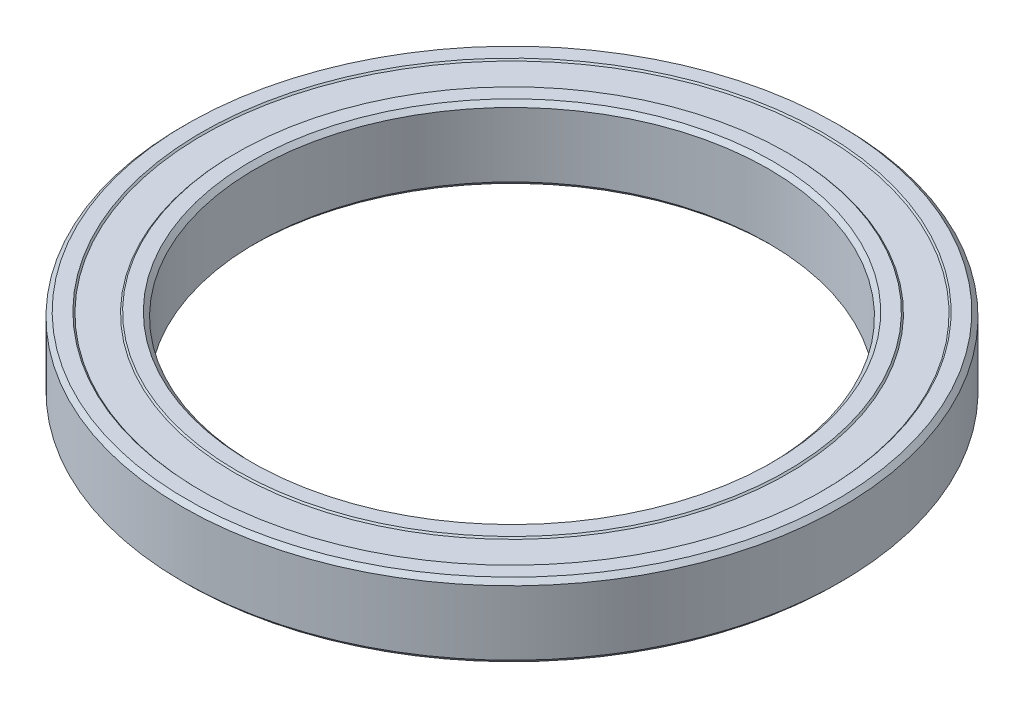
ISO-10303-21;
HEADER;
FILE_DESCRIPTION(('STEP AP214'),'2;1');
FILE_NAME('part.step','',(''),(''),'','','');
FILE_SCHEMA(('AUTOMOTIVE_DESIGN { 1 0 10303 214 1 1 1 1 }'));
ENDSEC;
DATA;
#1=APPLICATION_CONTEXT('core data for automotive mechanical design processes');
#2=APPLICATION_PROTOCOL_DEFINITION('international standard','automotive_design',2000,#1);
#3=PRODUCT_CONTEXT('',#1,'mechanical');
#4=PRODUCT('Part','Part','',(#3));
#5=PRODUCT_RELATED_PRODUCT_CATEGORY('part','',(#4));
#6=PRODUCT_DEFINITION_FORMATION('','',#4);
#7=PRODUCT_DEFINITION_CONTEXT('part definition',#1,'design');
#8=PRODUCT_DEFINITION('design','',#6,#7);
#9=PRODUCT_DEFINITION_SHAPE('','',#8);
#10=(LENGTH_UNIT() NAMED_UNIT(*) SI_UNIT(.MILLI.,.METRE.));
#11=(NAMED_UNIT(*) PLANE_ANGLE_UNIT() SI_UNIT($,.RADIAN.));
#12=(NAMED_UNIT(*) SI_UNIT($,.STERADIAN.) SOLID_ANGLE_UNIT());
#13=UNCERTAINTY_MEASURE_WITH_UNIT(LENGTH_MEASURE(1.E-05),#10,'distance_accuracy_value','');
#14=(GEOMETRIC_REPRESENTATION_CONTEXT(3) GLOBAL_UNCERTAINTY_ASSIGNED_CONTEXT((#13)) GLOBAL_UNIT_ASSIGNED_CONTEXT((#10,
#11,#12)) REPRESENTATION_CONTEXT('',''));
#15=CARTESIAN_POINT('',(0.,0.,0.));
#16=DIRECTION('',(0.,0.,1.));
#17=DIRECTION('',(1.,0.,0.));
#18=AXIS2_PLACEMENT_3D('',#15,#16,#17);
#19=CARTESIAN_POINT('',(0.,5.,0.));
#20=DIRECTION('',(0.,1.,0.));
#21=DIRECTION('',(0.,0.,1.));
#22=AXIS2_PLACEMENT_3D('',#19,#20,#21);
#23=CONICAL_SURFACE('',#22,35.6,0.785398163397448);
#24=CARTESIAN_POINT('',(0.,4.4,0.));
#25=DIRECTION('',(0.,-1.,0.));
#26=DIRECTION('',(0.,0.,-1.));
#27=AXIS2_PLACEMENT_3D('',#24,#25,#26);
#28=CIRCLE('',#27,35.);
#29=CARTESIAN_POINT('',(0.,4.4,-35.));
#30=VERTEX_POINT('',#29);
#31=EDGE_CURVE('E10',#30,#30,#28,.T.);
#32=ORIENTED_EDGE('',*,*,#31,.T.);
#33=EDGE_LOOP('',(#32));
#34=FACE_BOUND('',#33,.T.);
#35=CARTESIAN_POINT('',(0.,5.,0.));
#36=DIRECTION('',(0.,-1.,0.));
#37=DIRECTION('',(0.,0.,-1.));
#38=AXIS2_PLACEMENT_3D('',#35,#36,#37);
#39=CIRCLE('',#38,35.6);
#40=CARTESIAN_POINT('',(0.,5.,-35.6));
#41=VERTEX_POINT('',#40);
#42=EDGE_CURVE('E110',#41,#41,#39,.T.);
#43=ORIENTED_EDGE('',*,*,#42,.F.);
#44=EDGE_LOOP('',(#43));
#45=FACE_BOUND('',#44,.T.);
#46=ADVANCED_FACE('F43',(#34,#45),#23,.F.);
#47=CARTESIAN_POINT('',(0.,-1.34942197217015,0.));
#48=DIRECTION('',(0.,-1.,0.));
#49=DIRECTION('',(0.,0.,-1.));
#50=AXIS2_PLACEMENT_3D('',#47,#48,#49);
#51=CYLINDRICAL_SURFACE('',#50,35.);
#52=CARTESIAN_POINT('',(0.,-4.4,0.));
#53=DIRECTION('',(0.,-1.,0.));
#54=DIRECTION('',(0.,0.,-1.));
#55=AXIS2_PLACEMENT_3D('',#52,#53,#54);
#56=CIRCLE('',#55,35.);
#57=CARTESIAN_POINT('',(0.,-4.4,-35.));
#58=VERTEX_POINT('',#57);
#59=EDGE_CURVE('E50',#58,#58,#56,.T.);
#60=ORIENTED_EDGE('',*,*,#59,.T.);
#61=EDGE_LOOP('',(#60));
#62=FACE_BOUND('',#61,.T.);
#63=ORIENTED_EDGE('',*,*,#31,.F.);
#64=EDGE_LOOP('',(#63));
#65=FACE_BOUND('',#64,.T.);
#66=ADVANCED_FACE('F119',(#62,#65),#51,.F.);
#67=CARTESIAN_POINT('',(0.,-4.4,0.));
#68=DIRECTION('',(0.,-1.,0.));
#69=DIRECTION('',(0.,0.,-1.));
#70=AXIS2_PLACEMENT_3D('',#67,#68,#69);
#71=CONICAL_SURFACE('',#70,35.,0.78539816339745);
#72=CARTESIAN_POINT('',(0.,-5.,0.));
#73=DIRECTION('',(0.,-1.,0.));
#74=DIRECTION('',(0.,0.,-1.));
#75=AXIS2_PLACEMENT_3D('',#72,#73,#74);
#76=CIRCLE('',#75,35.6);
#77=CARTESIAN_POINT('',(0.,-5.,-35.6));
#78=VERTEX_POINT('',#77);
#79=EDGE_CURVE('E55',#78,#78,#76,.T.);
#80=ORIENTED_EDGE('',*,*,#79,.T.);
#81=EDGE_LOOP('',(#80));
#82=FACE_BOUND('',#81,.T.);
#83=ORIENTED_EDGE('',*,*,#59,.F.);
#84=EDGE_LOOP('',(#83));
#85=FACE_BOUND('',#84,.T.);
#86=ADVANCED_FACE('F123',(#82,#85),#71,.F.);
#87=CARTESIAN_POINT('',(35.6,-5.,0.));
#88=DIRECTION('',(0.,-1.,0.));
#89=DIRECTION('',(0.,0.,-1.));
#90=AXIS2_PLACEMENT_3D('',#87,#88,#89);
#91=PLANE('',#90);
#92=CARTESIAN_POINT('',(0.,-5.,0.));
#93=DIRECTION('',(0.,-1.,0.));
#94=DIRECTION('',(0.,0.,-1.));
#95=AXIS2_PLACEMENT_3D('',#92,#93,#94);
#96=CIRCLE('',#95,37.6);
#97=CARTESIAN_POINT('',(0.,-5.,-37.6));
#98=VERTEX_POINT('',#97);
#99=EDGE_CURVE('E60',#98,#98,#96,.T.);
#100=ORIENTED_EDGE('',*,*,#99,.T.);
#101=EDGE_LOOP('',(#100));
#102=FACE_BOUND('',#101,.T.);
#103=ORIENTED_EDGE('',*,*,#79,.F.);
#104=EDGE_LOOP('',(#103));
#105=FACE_BOUND('',#104,.T.);
#106=ADVANCED_FACE('F127',(#102,#105),#91,.T.);
#107=CARTESIAN_POINT('',(0.,-5.,0.));
#108=DIRECTION('',(0.,1.,0.));
#109=DIRECTION('',(0.,0.,1.));
#110=AXIS2_PLACEMENT_3D('',#107,#108,#109);
#111=CONICAL_SURFACE('',#110,37.6,0.785398163397446);
#112=CARTESIAN_POINT('',(0.,-4.8,0.));
#113=DIRECTION('',(0.,-1.,0.));
#114=DIRECTION('',(0.,0.,-1.));
#115=AXIS2_PLACEMENT_3D('',#112,#113,#114);
#116=CIRCLE('',#115,37.8);
#117=CARTESIAN_POINT('',(0.,-4.8,-37.8));
#118=VERTEX_POINT('',#117);
#119=EDGE_CURVE('E66',#118,#118,#116,.T.);
#120=ORIENTED_EDGE('',*,*,#119,.T.);
#121=EDGE_LOOP('',(#120));
#122=FACE_BOUND('',#121,.T.);
#123=ORIENTED_EDGE('',*,*,#99,.F.);
#124=EDGE_LOOP('',(#123));
#125=FACE_BOUND('',#124,.T.);
#126=ADVANCED_FACE('F134',(#122,#125),#111,.T.);
#127=CARTESIAN_POINT('',(37.8,-4.8,0.));
#128=DIRECTION('',(0.,-1.,0.));
#129=DIRECTION('',(0.,0.,-1.));
#130=AXIS2_PLACEMENT_3D('',#127,#128,#129);
#131=PLANE('',#130);
#132=CARTESIAN_POINT('',(0.,-4.8,0.));
#133=DIRECTION('',(0.,-1.,0.));
#134=DIRECTION('',(0.,0.,-1.));
#135=AXIS2_PLACEMENT_3D('',#132,#133,#134);
#136=CIRCLE('',#135,42.2);
#137=CARTESIAN_POINT('',(0.,-4.8,-42.2));
#138=VERTEX_POINT('',#137);
#139=EDGE_CURVE('E70',#138,#138,#136,.T.);
#140=ORIENTED_EDGE('',*,*,#139,.T.);
#141=EDGE_LOOP('',(#140));
#142=FACE_BOUND('',#141,.T.);
#143=ORIENTED_EDGE('',*,*,#119,.F.);
#144=EDGE_LOOP('',(#143));
#145=FACE_BOUND('',#144,.T.);
#146=ADVANCED_FACE('F138',(#142,#145),#131,.T.);
#147=CARTESIAN_POINT('',(0.,-4.8,0.));
#148=DIRECTION('',(0.,-1.,0.));
#149=DIRECTION('',(0.,0.,-1.));
#150=AXIS2_PLACEMENT_3D('',#147,#148,#149);
#151=CONICAL_SURFACE('',#150,42.2,0.785398163397444);
#152=CARTESIAN_POINT('',(0.,-5.,0.));
#153=DIRECTION('',(0.,-1.,0.));
#154=DIRECTION('',(0.,0.,-1.));
#155=AXIS2_PLACEMENT_3D('',#152,#153,#154);
#156=CIRCLE('',#155,42.4);
#157=CARTESIAN_POINT('',(0.,-5.,-42.4));
#158=VERTEX_POINT('',#157);
#159=EDGE_CURVE('E74',#158,#158,#156,.T.);
#160=ORIENTED_EDGE('',*,*,#159,.T.);
#161=EDGE_LOOP('',(#160));
#162=FACE_BOUND('',#161,.T.);
#163=ORIENTED_EDGE('',*,*,#139,.F.);
#164=EDGE_LOOP('',(#163));
#165=FACE_BOUND('',#164,.T.);
#166=ADVANCED_FACE('F142',(#162,#165),#151,.F.);
#167=CARTESIAN_POINT('',(42.4,-5.,0.));
#168=DIRECTION('',(0.,-1.,0.));
#169=DIRECTION('',(0.,0.,-1.));
#170=AXIS2_PLACEMENT_3D('',#167,#168,#169);
#171=PLANE('',#170);
#172=CARTESIAN_POINT('',(0.,-5.,0.));
#173=DIRECTION('',(0.,-1.,0.));
#174=DIRECTION('',(0.,0.,-1.));
#175=AXIS2_PLACEMENT_3D('',#172,#173,#174);
#176=CIRCLE('',#175,44.4);
#177=CARTESIAN_POINT('',(0.,-5.,-44.4));
#178=VERTEX_POINT('',#177);
#179=EDGE_CURVE('E78',#178,#178,#176,.T.);
#180=ORIENTED_EDGE('',*,*,#179,.T.);
#181=EDGE_LOOP('',(#180));
#182=FACE_BOUND('',#181,.T.);
#183=ORIENTED_EDGE('',*,*,#159,.F.);
#184=EDGE_LOOP('',(#183));
#185=FACE_BOUND('',#184,.T.);
#186=ADVANCED_FACE('F146',(#182,#185),#171,.T.);
#187=CARTESIAN_POINT('',(0.,-5.,0.));
#188=DIRECTION('',(0.,1.,0.));
#189=DIRECTION('',(0.,0.,1.));
#190=AXIS2_PLACEMENT_3D('',#187,#188,#189);
#191=CONICAL_SURFACE('',#190,44.4,0.785398163397449);
#192=CARTESIAN_POINT('',(0.,-4.4,0.));
#193=DIRECTION('',(0.,-1.,0.));
#194=DIRECTION('',(0.,0.,-1.));
#195=AXIS2_PLACEMENT_3D('',#192,#193,#194);
#196=CIRCLE('',#195,45.);
#197=CARTESIAN_POINT('',(0.,-4.4,-45.));
#198=VERTEX_POINT('',#197);
#199=EDGE_CURVE('E82',#198,#198,#196,.T.);
#200=ORIENTED_EDGE('',*,*,#199,.T.);
#201=EDGE_LOOP('',(#200));
#202=FACE_BOUND('',#201,.T.);
#203=ORIENTED_EDGE('',*,*,#179,.F.);
#204=EDGE_LOOP('',(#203));
#205=FACE_BOUND('',#204,.T.);
#206=ADVANCED_FACE('F150',(#202,#205),#191,.T.);
#207=CARTESIAN_POINT('',(0.,-1.34942197217015,0.));
#208=DIRECTION('',(0.,-1.,0.));
#209=DIRECTION('',(0.,0.,-1.));
#210=AXIS2_PLACEMENT_3D('',#207,#208,#209);
#211=CYLINDRICAL_SURFACE('',#210,45.);
#212=CARTESIAN_POINT('',(0.,4.4,0.));
#213=DIRECTION('',(0.,-1.,0.));
#214=DIRECTION('',(0.,0.,-1.));
#215=AXIS2_PLACEMENT_3D('',#212,#213,#214);
#216=CIRCLE('',#215,45.);
#217=CARTESIAN_POINT('',(0.,4.4,-45.));
#218=VERTEX_POINT('',#217);
#219=EDGE_CURVE('E86',#218,#218,#216,.T.);
#220=ORIENTED_EDGE('',*,*,#219,.T.);
#221=EDGE_LOOP('',(#220));
#222=FACE_BOUND('',#221,.T.);
#223=ORIENTED_EDGE('',*,*,#199,.F.);
#224=EDGE_LOOP('',(#223));
#225=FACE_BOUND('',#224,.T.);
#226=ADVANCED_FACE('F154',(#222,#225),#211,.T.);
#227=CARTESIAN_POINT('',(0.,4.4,0.));
#228=DIRECTION('',(0.,-1.,0.));
#229=DIRECTION('',(0.,0.,-1.));
#230=AXIS2_PLACEMENT_3D('',#227,#228,#229);
#231=CONICAL_SURFACE('',#230,45.,0.78539816339745);
#232=CARTESIAN_POINT('',(0.,5.,0.));
#233=DIRECTION('',(0.,-1.,0.));
#234=DIRECTION('',(0.,0.,-1.));
#235=AXIS2_PLACEMENT_3D('',#232,#233,#234);
#236=CIRCLE('',#235,44.4);
#237=CARTESIAN_POINT('',(0.,5.,-44.4));
#238=VERTEX_POINT('',#237);
#239=EDGE_CURVE('E90',#238,#238,#236,.T.);
#240=ORIENTED_EDGE('',*,*,#239,.T.);
#241=EDGE_LOOP('',(#240));
#242=FACE_BOUND('',#241,.T.);
#243=ORIENTED_EDGE('',*,*,#219,.F.);
#244=EDGE_LOOP('',(#243));
#245=FACE_BOUND('',#244,.T.);
#246=ADVANCED_FACE('F158',(#242,#245),#231,.T.);
#247=CARTESIAN_POINT('',(44.4,5.,0.));
#248=DIRECTION('',(0.,1.,0.));
#249=DIRECTION('',(0.,0.,1.));
#250=AXIS2_PLACEMENT_3D('',#247,#248,#249);
#251=PLANE('',#250);
#252=CARTESIAN_POINT('',(0.,5.,0.));
#253=DIRECTION('',(0.,-1.,0.));
#254=DIRECTION('',(0.,0.,-1.));
#255=AXIS2_PLACEMENT_3D('',#252,#253,#254);
#256=CIRCLE('',#255,42.4);
#257=CARTESIAN_POINT('',(0.,5.,-42.4));
#258=VERTEX_POINT('',#257);
#259=EDGE_CURVE('E94',#258,#258,#256,.T.);
#260=ORIENTED_EDGE('',*,*,#259,.T.);
#261=EDGE_LOOP('',(#260));
#262=FACE_BOUND('',#261,.T.);
#263=ORIENTED_EDGE('',*,*,#239,.F.);
#264=EDGE_LOOP('',(#263));
#265=FACE_BOUND('',#264,.T.);
#266=ADVANCED_FACE('F162',(#262,#265),#251,.T.);
#267=CARTESIAN_POINT('',(0.,5.,0.));
#268=DIRECTION('',(0.,1.,0.));
#269=DIRECTION('',(0.,0.,1.));
#270=AXIS2_PLACEMENT_3D('',#267,#268,#269);
#271=CONICAL_SURFACE('',#270,42.4,0.78539816339744);
#272=CARTESIAN_POINT('',(0.,4.8,0.));
#273=DIRECTION('',(0.,-1.,0.));
#274=DIRECTION('',(0.,0.,-1.));
#275=AXIS2_PLACEMENT_3D('',#272,#273,#274);
#276=CIRCLE('',#275,42.2);
#277=CARTESIAN_POINT('',(0.,4.8,-42.2));
#278=VERTEX_POINT('',#277);
#279=EDGE_CURVE('E98',#278,#278,#276,.T.);
#280=ORIENTED_EDGE('',*,*,#279,.T.);
#281=EDGE_LOOP('',(#280));
#282=FACE_BOUND('',#281,.T.);
#283=ORIENTED_EDGE('',*,*,#259,.F.);
#284=EDGE_LOOP('',(#283));
#285=FACE_BOUND('',#284,.T.);
#286=ADVANCED_FACE('F166',(#282,#285),#271,.F.);
#287=CARTESIAN_POINT('',(42.2,4.8,0.));
#288=DIRECTION('',(0.,1.,0.));
#289=DIRECTION('',(0.,0.,1.));
#290=AXIS2_PLACEMENT_3D('',#287,#288,#289);
#291=PLANE('',#290);
#292=CARTESIAN_POINT('',(0.,4.8,0.));
#293=DIRECTION('',(0.,-1.,0.));
#294=DIRECTION('',(0.,0.,-1.));
#295=AXIS2_PLACEMENT_3D('',#292,#293,#294);
#296=CIRCLE('',#295,37.8);
#297=CARTESIAN_POINT('',(0.,4.8,-37.8));
#298=VERTEX_POINT('',#297);
#299=EDGE_CURVE('E102',#298,#298,#296,.T.);
#300=ORIENTED_EDGE('',*,*,#299,.T.);
#301=EDGE_LOOP('',(#300));
#302=FACE_BOUND('',#301,.T.);
#303=ORIENTED_EDGE('',*,*,#279,.F.);
#304=EDGE_LOOP('',(#303));
#305=FACE_BOUND('',#304,.T.);
#306=ADVANCED_FACE('F170',(#302,#305),#291,.T.);
#307=CARTESIAN_POINT('',(0.,4.8,0.));
#308=DIRECTION('',(0.,-1.,0.));
#309=DIRECTION('',(0.,0.,-1.));
#310=AXIS2_PLACEMENT_3D('',#307,#308,#309);
#311=CONICAL_SURFACE('',#310,37.8,0.785398163397453);
#312=CARTESIAN_POINT('',(0.,5.,0.));
#313=DIRECTION('',(0.,-1.,0.));
#314=DIRECTION('',(0.,0.,-1.));
#315=AXIS2_PLACEMENT_3D('',#312,#313,#314);
#316=CIRCLE('',#315,37.6);
#317=CARTESIAN_POINT('',(0.,5.,-37.6));
#318=VERTEX_POINT('',#317);
#319=EDGE_CURVE('E106',#318,#318,#316,.T.);
#320=ORIENTED_EDGE('',*,*,#319,.T.);
#321=EDGE_LOOP('',(#320));
#322=FACE_BOUND('',#321,.T.);
#323=ORIENTED_EDGE('',*,*,#299,.F.);
#324=EDGE_LOOP('',(#323));
#325=FACE_BOUND('',#324,.T.);
#326=ADVANCED_FACE('F174',(#322,#325),#311,.T.);
#327=CARTESIAN_POINT('',(37.6,5.,0.));
#328=DIRECTION('',(0.,1.,0.));
#329=DIRECTION('',(0.,0.,1.));
#330=AXIS2_PLACEMENT_3D('',#327,#328,#329);
#331=PLANE('',#330);
#332=ORIENTED_EDGE('',*,*,#42,.T.);
#333=EDGE_LOOP('',(#332));
#334=FACE_BOUND('',#333,.T.);
#335=ORIENTED_EDGE('',*,*,#319,.F.);
#336=EDGE_LOOP('',(#335));
#337=FACE_BOUND('',#336,.T.);
#338=ADVANCED_FACE('F115',(#334,#337),#331,.T.);
#339=CLOSED_SHELL('',(#46,#66,#86,#106,#126,#146,#166,#186,#206,#226,#246,#266,#286,#306,#326,#338));
#340=MANIFOLD_SOLID_BREP('B2',#339);
#341=ADVANCED_BREP_SHAPE_REPRESENTATION('',(#18,#340),#14);
#342=SHAPE_DEFINITION_REPRESENTATION(#9,#341);
ENDSEC;
END-ISO-10303-21;
